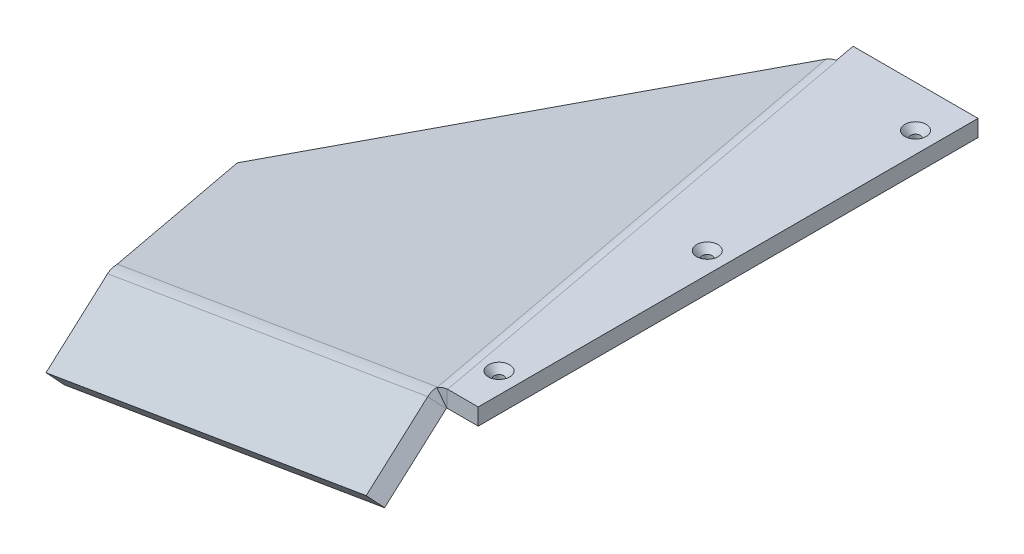
ISO-10303-21;
HEADER;
FILE_DESCRIPTION(('STEP AP214'),'2;1');
FILE_NAME('part.step','',(''),(''),'','','');
FILE_SCHEMA(('AUTOMOTIVE_DESIGN { 1 0 10303 214 1 1 1 1 }'));
ENDSEC;
DATA;
#1=APPLICATION_CONTEXT('core data for automotive mechanical design processes');
#2=APPLICATION_PROTOCOL_DEFINITION('international standard','automotive_design',2000,#1);
#3=PRODUCT_CONTEXT('',#1,'mechanical');
#4=PRODUCT('Part','Part','',(#3));
#5=PRODUCT_RELATED_PRODUCT_CATEGORY('part','',(#4));
#6=PRODUCT_DEFINITION_FORMATION('','',#4);
#7=PRODUCT_DEFINITION_CONTEXT('part definition',#1,'design');
#8=PRODUCT_DEFINITION('design','',#6,#7);
#9=PRODUCT_DEFINITION_SHAPE('','',#8);
#10=(LENGTH_UNIT() NAMED_UNIT(*) SI_UNIT(.MILLI.,.METRE.));
#11=(NAMED_UNIT(*) PLANE_ANGLE_UNIT() SI_UNIT($,.RADIAN.));
#12=(NAMED_UNIT(*) SI_UNIT($,.STERADIAN.) SOLID_ANGLE_UNIT());
#13=UNCERTAINTY_MEASURE_WITH_UNIT(LENGTH_MEASURE(1.E-05),#10,'distance_accuracy_value','');
#14=(GEOMETRIC_REPRESENTATION_CONTEXT(3) GLOBAL_UNCERTAINTY_ASSIGNED_CONTEXT((#13)) GLOBAL_UNIT_ASSIGNED_CONTEXT((#10,
#11,#12)) REPRESENTATION_CONTEXT('',''));
#15=CARTESIAN_POINT('',(0.,0.,0.));
#16=DIRECTION('',(0.,0.,1.));
#17=DIRECTION('',(1.,0.,0.));
#18=AXIS2_PLACEMENT_3D('',#15,#16,#17);
#19=CARTESIAN_POINT('',(-179.784736318723,-93.9799999999991,3.68196416054327));
#20=DIRECTION('',(0.829298407725834,0.433012701892212,0.353219692179532));
#21=DIRECTION('',(-0.462847675696148,0.886437831493373,0.));
#22=AXIS2_PLACEMENT_3D('',#19,#20,#21);
#23=PLANE('',#22);
#24=DIRECTION('',(0.491436093467156,-0.866025403784441,-0.0921442675250917));
#25=VECTOR('',#24,1.);
#26=CARTESIAN_POINT('',(-182.281231673536,-89.5805909487741,4.15005703957071));
#27=LINE('',#26,#25);
#28=CARTESIAN_POINT('',(-182.281231673536,-89.5805909487741,4.15005703957071));
#29=VERTEX_POINT('',#28);
#30=CARTESIAN_POINT('',(-182.279585554428,-89.5834917958712,4.14974839223797));
#31=VERTEX_POINT('',#30);
#32=EDGE_CURVE('E471',#29,#31,#27,.T.);
#33=ORIENTED_EDGE('',*,*,#32,.T.);
#34=CARTESIAN_POINT('',(-179.370244182487,-94.5685714686407,3.43033960882663));
#35=DIRECTION('',(-0.829298407725834,-0.433012701892215,-0.353219692179528));
#36=DIRECTION('',(0.46284767569615,-0.886437831493372,0.));
#37=AXIS2_PLACEMENT_3D('',#34,#35,#36);
#38=CIRCLE('',#37,5.8165999999998);
#39=CARTESIAN_POINT('',(-182.228731363748,-89.5312481049879,3.96630595531323));
#40=VERTEX_POINT('',#39);
#41=EDGE_CURVE('E11',#31,#40,#38,.T.);
#42=ORIENTED_EDGE('',*,*,#41,.T.);
#43=DIRECTION('',(0.265997588299476,0.250000000000002,-0.930991559048126));
#44=VECTOR('',#43,1.);
#45=CARTESIAN_POINT('',(-162.399193038281,-70.8942949917687,-65.4370781838173));
#46=LINE('',#45,#44);
#47=EDGE_CURVE('E441',#29,#40,#46,.T.);
#48=ORIENTED_EDGE('',*,*,#47,.F.);
#49=EDGE_LOOP('',(#33,#42,#48));
#50=FACE_BOUND('',#49,.T.);
#51=ADVANCED_FACE('F38',(#50),#23,.T.);
#52=CARTESIAN_POINT('',(-6.08541035334141,10.7239171654345,1.14101444125151));
#53=DIRECTION('',(-0.491436093467156,0.866025403784442,0.0921442675250916));
#54=DIRECTION('',(-0.869725505435452,-0.493535758780503,0.));
#55=AXIS2_PLACEMENT_3D('',#52,#53,#54);
#56=PLANE('',#55);
#57=DIRECTION('',(-0.184288535050185,0.,-0.982872186934322));
#58=VECTOR('',#57,1.);
#59=CARTESIAN_POINT('',(-190.768250996109,-89.5805909487741,-41.1140460141519));
#60=LINE('',#59,#58);
#61=CARTESIAN_POINT('',(-190.768250996109,-89.5805909487741,-41.1140460141519));
#62=VERTEX_POINT('',#61);
#63=EDGE_CURVE('E461',#29,#62,#60,.T.);
#64=ORIENTED_EDGE('',*,*,#63,.F.);
#65=ORIENTED_EDGE('',*,*,#47,.T.);
#66=DIRECTION('',(-0.829298407725834,-0.433012701892215,-0.353219692179528));
#67=VECTOR('',#66,1.);
#68=CARTESIAN_POINT('',(-182.228731363748,-89.5312481049885,3.96630595531413));
#69=LINE('',#68,#67);
#70=CARTESIAN_POINT('',(-12.2524967178797,-0.779276636347389,76.3635910822581));
#71=VERTEX_POINT('',#70);
#72=EDGE_CURVE('E203',#40,#71,#69,.F.);
#73=ORIENTED_EDGE('',*,*,#72,.T.);
#74=DIRECTION('',(-0.184288535050185,0.,-0.982872186934322));
#75=VECTOR('',#74,1.);
#76=CARTESIAN_POINT('',(-25.66826993104,-0.779276636347404,4.81280061206999));
#77=LINE('',#76,#75);
#78=CARTESIAN_POINT('',(-39.5942641485656,-0.779276636347423,-69.4591685480669));
#79=VERTEX_POINT('',#78);
#80=EDGE_CURVE('E451',#71,#79,#77,.T.);
#81=ORIENTED_EDGE('',*,*,#80,.T.);
#82=DIRECTION('',(0.851192282558293,0.499999999999995,-0.159598552979683));
#83=VECTOR('',#82,1.);
#84=CARTESIAN_POINT('',(-39.4262631572444,-0.680590948775023,-69.4906687339396));
#85=LINE('',#84,#83);
#86=EDGE_CURVE('E458',#62,#79,#85,.T.);
#87=ORIENTED_EDGE('',*,*,#86,.F.);
#88=EDGE_LOOP('',(#64,#65,#73,#81,#87));
#89=FACE_BOUND('',#88,.T.);
#90=ADVANCED_FACE('F251',(#89),#56,.T.);
#91=CARTESIAN_POINT('',(-3.58891499852826,6.32450811420956,0.672921562224048));
#92=DIRECTION('',(-0.491436093467156,0.866025403784442,0.0921442675250916));
#93=DIRECTION('',(-0.869725505435452,-0.493535758780503,0.));
#94=AXIS2_PLACEMENT_3D('',#91,#92,#93);
#95=PLANE('',#94);
#96=DIRECTION('',(0.265997588300528,0.249999999998149,-0.930991559048324));
#97=VECTOR('',#96,1.);
#98=CARTESIAN_POINT('',(-179.784736318723,-93.9799999999991,3.68196416054327));
#99=LINE('',#98,#97);
#100=CARTESIAN_POINT('',(-179.784736318723,-93.9799999999991,3.68196416054327));
#101=VERTEX_POINT('',#100);
#102=CARTESIAN_POINT('',(-179.732236008935,-93.9306571562133,3.49821307628573));
#103=VERTEX_POINT('',#102);
#104=EDGE_CURVE('E215',#101,#103,#99,.T.);
#105=ORIENTED_EDGE('',*,*,#104,.F.);
#106=DIRECTION('',(-0.184288535050185,0.,-0.982872186934322));
#107=VECTOR('',#106,1.);
#108=CARTESIAN_POINT('',(-188.271755641296,-93.9799999999991,-41.5821388931794));
#109=LINE('',#108,#107);
#110=CARTESIAN_POINT('',(-188.271755641296,-93.9799999999991,-41.5821388931794));
#111=VERTEX_POINT('',#110);
#112=EDGE_CURVE('E462',#101,#111,#109,.T.);
#113=ORIENTED_EDGE('',*,*,#112,.T.);
#114=DIRECTION('',(0.851192282558293,0.499999999999995,-0.159598552979683));
#115=VECTOR('',#114,1.);
#116=CARTESIAN_POINT('',(-36.9297678024313,-5.07999999999999,-69.9587616129671));
#117=LINE('',#116,#115);
#118=CARTESIAN_POINT('',(-37.0977687937524,-5.17868568757246,-69.9272614270944));
#119=VERTEX_POINT('',#118);
#120=EDGE_CURVE('E457',#111,#119,#117,.T.);
#121=ORIENTED_EDGE('',*,*,#120,.T.);
#122=DIRECTION('',(-0.184288535050185,0.,-0.982872186934322));
#123=VECTOR('',#122,1.);
#124=CARTESIAN_POINT('',(-9.71400111523626,-5.17868568757238,76.119499524992));
#125=LINE('',#124,#123);
#126=CARTESIAN_POINT('',(-9.75600136306651,-5.17868568757238,75.8954982032307));
#127=VERTEX_POINT('',#126);
#128=EDGE_CURVE('E449',#127,#119,#125,.T.);
#129=ORIENTED_EDGE('',*,*,#128,.F.);
#130=DIRECTION('',(-0.829298407725834,-0.433012701892215,-0.353219692179528));
#131=VECTOR('',#130,1.);
#132=CARTESIAN_POINT('',(-179.732236008935,-93.9306571562133,3.49821307628571));
#133=LINE('',#132,#131);
#134=EDGE_CURVE('E207',#103,#127,#133,.F.);
#135=ORIENTED_EDGE('',*,*,#134,.F.);
#136=EDGE_LOOP('',(#105,#113,#121,#129,#135));
#137=FACE_BOUND('',#136,.T.);
#138=ADVANCED_FACE('F256',(#137),#95,.F.);
#139=CARTESIAN_POINT('',(-36.9297678024313,-5.07999999999999,-69.9587616129671));
#140=DIRECTION('',(0.184288535050179,0.,0.982872186934323));
#141=DIRECTION('',(0.982872186934323,0.,-0.184288535050179));
#142=AXIS2_PLACEMENT_3D('',#139,#140,#141);
#143=PLANE('',#142);
#144=DIRECTION('',(0.,1.,0.));
#145=VECTOR('',#144,1.);
#146=CARTESIAN_POINT('',(-36.9297678024313,-5.07999999999999,-69.9587616129671));
#147=LINE('',#146,#145);
#148=CARTESIAN_POINT('',(-36.9297678024313,-0.00334960970435876,-69.9587616129671));
#149=VERTEX_POINT('',#148);
#150=CARTESIAN_POINT('',(-36.9297678024313,0.,-69.9587616129671));
#151=VERTEX_POINT('',#150);
#152=EDGE_CURVE('E364',#149,#151,#147,.T.);
#153=ORIENTED_EDGE('',*,*,#152,.F.);
#154=CARTESIAN_POINT('',(-36.7357769673045,-5.81660000000001,-69.9951348945533));
#155=DIRECTION('',(-0.184288535050185,0.,-0.982872186934322));
#156=DIRECTION('',(-0.982872186934322,0.,0.184288535050185));
#157=AXIS2_PLACEMENT_3D('',#154,#155,#156);
#158=CIRCLE('',#157,5.81659999999992);
#159=CARTESIAN_POINT('',(-36.7357769673046,0.,-69.9951348945533));
#160=VERTEX_POINT('',#159);
#161=EDGE_CURVE('E47',#149,#160,#158,.T.);
#162=ORIENTED_EDGE('',*,*,#161,.T.);
#163=DIRECTION('',(-0.982872186934323,0.,0.184288535050179));
#164=VECTOR('',#163,1.);
#165=CARTESIAN_POINT('',(-13.9259942175252,0.,-74.2719691601368));
#166=LINE('',#165,#164);
#167=EDGE_CURVE('E398',#160,#151,#166,.T.);
#168=ORIENTED_EDGE('',*,*,#167,.T.);
#169=EDGE_LOOP('',(#153,#162,#168));
#170=FACE_BOUND('',#169,.T.);
#171=ADVANCED_FACE('F264',(#170),#143,.T.);
#172=CARTESIAN_POINT('',(-9.52499999999998,-5.08,76.2));
#173=DIRECTION('',(-0.982872186934322,0.,0.184288535050185));
#174=DIRECTION('',(0.184288535050185,0.,0.982872186934322));
#175=AXIS2_PLACEMENT_3D('',#172,#173,#174);
#176=PLANE('',#175);
#177=DIRECTION('',(0.184288535050185,0.,0.982872186934322));
#178=VECTOR('',#177,1.);
#179=CARTESIAN_POINT('',(-9.52499999999998,-5.08,76.2));
#180=LINE('',#179,#178);
#181=CARTESIAN_POINT('',(-38.1,-5.08,-76.2));
#182=VERTEX_POINT('',#181);
#183=CARTESIAN_POINT('',(-36.9297678024313,-5.08,-69.9587616129671));
#184=VERTEX_POINT('',#183);
#185=EDGE_CURVE('E344',#182,#184,#180,.T.);
#186=ORIENTED_EDGE('',*,*,#185,.T.);
#187=EDGE_CURVE('E346',#184,#149,#147,.T.);
#188=ORIENTED_EDGE('',*,*,#187,.T.);
#189=ORIENTED_EDGE('',*,*,#152,.T.);
#190=DIRECTION('',(0.184288535050185,0.,0.982872186934322));
#191=VECTOR('',#190,1.);
#192=CARTESIAN_POINT('',(-9.52499999999998,0.,76.2));
#193=LINE('',#192,#191);
#194=CARTESIAN_POINT('',(-38.1,0.,-76.2));
#195=VERTEX_POINT('',#194);
#196=EDGE_CURVE('E379',#195,#151,#193,.T.);
#197=ORIENTED_EDGE('',*,*,#196,.F.);
#198=DIRECTION('',(0.,1.,0.));
#199=VECTOR('',#198,1.);
#200=CARTESIAN_POINT('',(-38.1,-5.08,-76.2));
#201=LINE('',#200,#199);
#202=EDGE_CURVE('E349',#182,#195,#201,.T.);
#203=ORIENTED_EDGE('',*,*,#202,.F.);
#204=EDGE_LOOP('',(#186,#188,#189,#197,#203));
#205=FACE_BOUND('',#204,.T.);
#206=ADVANCED_FACE('F321',(#205),#176,.T.);
#207=CARTESIAN_POINT('',(0.,-5.08,0.));
#208=DIRECTION('',(0.,-1.,0.));
#209=DIRECTION('',(0.,0.,-1.));
#210=AXIS2_PLACEMENT_3D('',#207,#208,#209);
#211=PLANE('',#210);
#212=CARTESIAN_POINT('',(-6.34999999999998,-5.08,-63.5));
#213=DIRECTION('',(0.,-1.,0.));
#214=DIRECTION('',(0.,0.,-1.));
#215=AXIS2_PLACEMENT_3D('',#212,#213,#214);
#216=CIRCLE('',#215,1.47319999999999);
#217=CARTESIAN_POINT('',(-6.34999999999998,-5.08,-64.9732));
#218=VERTEX_POINT('',#217);
#219=EDGE_CURVE('E42',#218,#218,#216,.T.);
#220=ORIENTED_EDGE('',*,*,#219,.F.);
#221=EDGE_LOOP('',(#220));
#222=FACE_BOUND('',#221,.T.);
#223=CARTESIAN_POINT('',(-6.34999999999997,-5.08,0.));
#224=DIRECTION('',(0.,-1.,0.));
#225=DIRECTION('',(0.,0.,-1.));
#226=AXIS2_PLACEMENT_3D('',#223,#224,#225);
#227=CIRCLE('',#226,1.47319999999999);
#228=CARTESIAN_POINT('',(-6.34999999999997,-5.08,-1.47319999999999));
#229=VERTEX_POINT('',#228);
#230=EDGE_CURVE('E404',#229,#229,#227,.T.);
#231=ORIENTED_EDGE('',*,*,#230,.F.);
#232=EDGE_LOOP('',(#231));
#233=FACE_BOUND('',#232,.T.);
#234=CARTESIAN_POINT('',(-6.34999999999996,-5.08,63.5));
#235=DIRECTION('',(0.,-1.,0.));
#236=DIRECTION('',(0.,0.,-1.));
#237=AXIS2_PLACEMENT_3D('',#234,#235,#236);
#238=CIRCLE('',#237,1.47319999999999);
#239=CARTESIAN_POINT('',(-6.34999999999996,-5.08,62.0268));
#240=VERTEX_POINT('',#239);
#241=EDGE_CURVE('E401',#240,#240,#238,.T.);
#242=ORIENTED_EDGE('',*,*,#241,.F.);
#243=EDGE_LOOP('',(#242));
#244=FACE_BOUND('',#243,.T.);
#245=DIRECTION('',(-0.184288535050185,0.,-0.982872186934322));
#246=VECTOR('',#245,1.);
#247=CARTESIAN_POINT('',(-36.7357769673046,-5.08000000000009,-69.9951348945534));
#248=LINE('',#247,#246);
#249=CARTESIAN_POINT('',(-36.7357769673046,-5.08000000000009,-69.9951348945533));
#250=VERTEX_POINT('',#249);
#251=CARTESIAN_POINT('',(-9.33100916487329,-5.08,76.1636267184138));
#252=VERTEX_POINT('',#251);
#253=EDGE_CURVE('E475',#250,#252,#248,.F.);
#254=ORIENTED_EDGE('',*,*,#253,.F.);
#255=DIRECTION('',(0.982872186934323,-5.27348043667875E-13,-0.184288535050179));
#256=VECTOR('',#255,1.);
#257=CARTESIAN_POINT('',(-36.9297678024313,-5.07999999999999,-69.9587616129671));
#258=LINE('',#257,#256);
#259=EDGE_CURVE('E359',#184,#250,#258,.T.);
#260=ORIENTED_EDGE('',*,*,#259,.F.);
#261=ORIENTED_EDGE('',*,*,#185,.F.);
#262=DIRECTION('',(-1.,0.,0.));
#263=VECTOR('',#262,1.);
#264=CARTESIAN_POINT('',(-38.1,-5.08,-76.2));
#265=LINE('',#264,#263);
#266=CARTESIAN_POINT('',(0.,-5.08,-76.2));
#267=VERTEX_POINT('',#266);
#268=EDGE_CURVE('E354',#267,#182,#265,.T.);
#269=ORIENTED_EDGE('',*,*,#268,.F.);
#270=DIRECTION('',(0.,0.,-1.));
#271=VECTOR('',#270,1.);
#272=CARTESIAN_POINT('',(0.,-5.08,-76.2));
#273=LINE('',#272,#271);
#274=CARTESIAN_POINT('',(0.,-5.08,76.2));
#275=VERTEX_POINT('',#274);
#276=EDGE_CURVE('E374',#275,#267,#273,.T.);
#277=ORIENTED_EDGE('',*,*,#276,.F.);
#278=DIRECTION('',(1.,0.,0.));
#279=VECTOR('',#278,1.);
#280=CARTESIAN_POINT('',(0.,-5.08,76.2));
#281=LINE('',#280,#279);
#282=CARTESIAN_POINT('',(-9.52499999999998,-5.08,76.2));
#283=VERTEX_POINT('',#282);
#284=EDGE_CURVE('E353',#283,#275,#281,.T.);
#285=ORIENTED_EDGE('',*,*,#284,.F.);
#286=DIRECTION('',(-0.982872186934341,0.,0.184288535050081));
#287=VECTOR('',#286,1.);
#288=CARTESIAN_POINT('',(-9.33100916487329,-5.08000000000001,76.1636267184138));
#289=LINE('',#288,#287);
#290=EDGE_CURVE('E367',#252,#283,#289,.T.);
#291=ORIENTED_EDGE('',*,*,#290,.F.);
#292=EDGE_LOOP('',(#254,#260,#261,#269,#277,#285,#291));
#293=FACE_BOUND('',#292,.T.);
#294=ADVANCED_FACE('F323',(#222,#233,#244,#293),#211,.T.);
#295=CARTESIAN_POINT('',(0.,0.,0.));
#296=DIRECTION('',(0.,-1.,0.));
#297=DIRECTION('',(0.,0.,-1.));
#298=AXIS2_PLACEMENT_3D('',#295,#296,#297);
#299=PLANE('',#298);
#300=CARTESIAN_POINT('',(-6.34999999999998,0.,-63.5));
#301=DIRECTION('',(0.,1.,0.));
#302=DIRECTION('',(0.,0.,1.));
#303=AXIS2_PLACEMENT_3D('',#300,#301,#302);
#304=CIRCLE('',#303,3.2385);
#305=CARTESIAN_POINT('',(-6.34999999999998,0.,-60.2615));
#306=VERTEX_POINT('',#305);
#307=EDGE_CURVE('E694',#306,#306,#304,.T.);
#308=ORIENTED_EDGE('',*,*,#307,.F.);
#309=EDGE_LOOP('',(#308));
#310=FACE_BOUND('',#309,.T.);
#311=CARTESIAN_POINT('',(-6.34999999999997,0.,0.));
#312=DIRECTION('',(0.,1.,0.));
#313=DIRECTION('',(0.,0.,1.));
#314=AXIS2_PLACEMENT_3D('',#311,#312,#313);
#315=CIRCLE('',#314,3.2385);
#316=CARTESIAN_POINT('',(-6.34999999999997,0.,3.2385));
#317=VERTEX_POINT('',#316);
#318=EDGE_CURVE('E413',#317,#317,#315,.T.);
#319=ORIENTED_EDGE('',*,*,#318,.F.);
#320=EDGE_LOOP('',(#319));
#321=FACE_BOUND('',#320,.T.);
#322=CARTESIAN_POINT('',(-6.34999999999996,0.,63.5));
#323=DIRECTION('',(0.,1.,0.));
#324=DIRECTION('',(0.,0.,1.));
#325=AXIS2_PLACEMENT_3D('',#322,#323,#324);
#326=CIRCLE('',#325,3.2385);
#327=CARTESIAN_POINT('',(-6.34999999999996,0.,66.7385));
#328=VERTEX_POINT('',#327);
#329=EDGE_CURVE('E406',#328,#328,#326,.T.);
#330=ORIENTED_EDGE('',*,*,#329,.F.);
#331=EDGE_LOOP('',(#330));
#332=FACE_BOUND('',#331,.T.);
#333=ORIENTED_EDGE('',*,*,#167,.F.);
#334=DIRECTION('',(-0.184288535050185,0.,-0.982872186934322));
#335=VECTOR('',#334,1.);
#336=CARTESIAN_POINT('',(-36.7357769673047,0.,-69.9951348945533));
#337=LINE('',#336,#335);
#338=CARTESIAN_POINT('',(-9.33100916487329,0.,76.1636267184138));
#339=VERTEX_POINT('',#338);
#340=EDGE_CURVE('E291',#160,#339,#337,.F.);
#341=ORIENTED_EDGE('',*,*,#340,.T.);
#342=DIRECTION('',(0.982872186934342,0.,-0.184288535050081));
#343=VECTOR('',#342,1.);
#344=CARTESIAN_POINT('',(13.4787735848985,0.,71.8867924528341));
#345=LINE('',#344,#343);
#346=CARTESIAN_POINT('',(-9.52499999999998,0.,76.2));
#347=VERTEX_POINT('',#346);
#348=EDGE_CURVE('E389',#347,#339,#345,.T.);
#349=ORIENTED_EDGE('',*,*,#348,.F.);
#350=DIRECTION('',(1.,0.,0.));
#351=VECTOR('',#350,1.);
#352=CARTESIAN_POINT('',(0.,0.,76.2));
#353=LINE('',#352,#351);
#354=CARTESIAN_POINT('',(0.,0.,76.2));
#355=VERTEX_POINT('',#354);
#356=EDGE_CURVE('E382',#347,#355,#353,.T.);
#357=ORIENTED_EDGE('',*,*,#356,.T.);
#358=DIRECTION('',(0.,0.,-1.));
#359=VECTOR('',#358,1.);
#360=CARTESIAN_POINT('',(0.,0.,-76.2));
#361=LINE('',#360,#359);
#362=CARTESIAN_POINT('',(0.,0.,-76.2));
#363=VERTEX_POINT('',#362);
#364=EDGE_CURVE('E370',#355,#363,#361,.T.);
#365=ORIENTED_EDGE('',*,*,#364,.T.);
#366=DIRECTION('',(-1.,0.,0.));
#367=VECTOR('',#366,1.);
#368=CARTESIAN_POINT('',(-38.1,0.,-76.2));
#369=LINE('',#368,#367);
#370=EDGE_CURVE('E366',#363,#195,#369,.T.);
#371=ORIENTED_EDGE('',*,*,#370,.T.);
#372=ORIENTED_EDGE('',*,*,#196,.T.);
#373=EDGE_LOOP('',(#333,#341,#349,#357,#365,#371,#372));
#374=FACE_BOUND('',#373,.T.);
#375=ADVANCED_FACE('F326',(#310,#321,#332,#374),#299,.F.);
#376=CARTESIAN_POINT('',(-38.1,-5.08,-76.2));
#377=DIRECTION('',(0.,0.,-1.));
#378=DIRECTION('',(-1.,0.,0.));
#379=AXIS2_PLACEMENT_3D('',#376,#377,#378);
#380=PLANE('',#379);
#381=ORIENTED_EDGE('',*,*,#370,.F.);
#382=DIRECTION('',(0.,1.,0.));
#383=VECTOR('',#382,1.);
#384=CARTESIAN_POINT('',(0.,-5.08,-76.2));
#385=LINE('',#384,#383);
#386=EDGE_CURVE('E387',#267,#363,#385,.T.);
#387=ORIENTED_EDGE('',*,*,#386,.F.);
#388=ORIENTED_EDGE('',*,*,#268,.T.);
#389=ORIENTED_EDGE('',*,*,#202,.T.);
#390=EDGE_LOOP('',(#381,#387,#388,#389));
#391=FACE_BOUND('',#390,.T.);
#392=ADVANCED_FACE('F40',(#391),#380,.T.);
#393=CARTESIAN_POINT('',(0.,-5.08,-76.2));
#394=DIRECTION('',(1.,0.,0.));
#395=DIRECTION('',(0.,0.,-1.));
#396=AXIS2_PLACEMENT_3D('',#393,#394,#395);
#397=PLANE('',#396);
#398=ORIENTED_EDGE('',*,*,#364,.F.);
#399=DIRECTION('',(0.,1.,0.));
#400=VECTOR('',#399,1.);
#401=CARTESIAN_POINT('',(0.,-5.08,76.2));
#402=LINE('',#401,#400);
#403=EDGE_CURVE('E390',#275,#355,#402,.T.);
#404=ORIENTED_EDGE('',*,*,#403,.F.);
#405=ORIENTED_EDGE('',*,*,#276,.T.);
#406=ORIENTED_EDGE('',*,*,#386,.T.);
#407=EDGE_LOOP('',(#398,#404,#405,#406));
#408=FACE_BOUND('',#407,.T.);
#409=ADVANCED_FACE('F331',(#408),#397,.T.);
#410=CARTESIAN_POINT('',(0.,-5.08,76.2));
#411=DIRECTION('',(0.,0.,1.));
#412=DIRECTION('',(1.,0.,0.));
#413=AXIS2_PLACEMENT_3D('',#410,#411,#412);
#414=PLANE('',#413);
#415=ORIENTED_EDGE('',*,*,#356,.F.);
#416=DIRECTION('',(0.,1.,0.));
#417=VECTOR('',#416,1.);
#418=CARTESIAN_POINT('',(-9.52499999999998,-5.08,76.2));
#419=LINE('',#418,#417);
#420=EDGE_CURVE('E392',#283,#347,#419,.T.);
#421=ORIENTED_EDGE('',*,*,#420,.F.);
#422=ORIENTED_EDGE('',*,*,#284,.T.);
#423=ORIENTED_EDGE('',*,*,#403,.T.);
#424=EDGE_LOOP('',(#415,#421,#422,#423));
#425=FACE_BOUND('',#424,.T.);
#426=ADVANCED_FACE('F317',(#425),#414,.T.);
#427=CARTESIAN_POINT('',(-9.33100916487329,-5.08000000000001,76.1636267184138));
#428=DIRECTION('',(-0.184288535050081,0.,-0.982872186934341));
#429=DIRECTION('',(-0.982872186934342,0.,0.184288535050081));
#430=AXIS2_PLACEMENT_3D('',#427,#428,#429);
#431=PLANE('',#430);
#432=ORIENTED_EDGE('',*,*,#420,.T.);
#433=ORIENTED_EDGE('',*,*,#348,.T.);
#434=DIRECTION('',(0.,1.,0.));
#435=VECTOR('',#434,1.);
#436=CARTESIAN_POINT('',(-9.33100916487331,-5.08000000000001,76.1636267184137));
#437=LINE('',#436,#435);
#438=EDGE_CURVE('E290',#252,#339,#437,.T.);
#439=ORIENTED_EDGE('',*,*,#438,.F.);
#440=ORIENTED_EDGE('',*,*,#290,.T.);
#441=EDGE_LOOP('',(#432,#433,#439,#440));
#442=FACE_BOUND('',#441,.T.);
#443=ADVANCED_FACE('F313',(#442),#431,.T.);
#444=CARTESIAN_POINT('',(-36.7357769673045,-5.81660000000001,-69.9951348945533));
#445=DIRECTION('',(0.184288535050185,0.,0.982872186934322));
#446=DIRECTION('',(0.982872186934322,0.,-0.184288535050185));
#447=AXIS2_PLACEMENT_3D('',#444,#445,#446);
#448=PLANE('',#447);
#449=ORIENTED_EDGE('',*,*,#187,.F.);
#450=ORIENTED_EDGE('',*,*,#259,.T.);
#451=CARTESIAN_POINT('',(-36.7357769673045,-5.81660000000001,-69.9951348945533));
#452=DIRECTION('',(-0.184288535050185,0.,-0.982872186934322));
#453=DIRECTION('',(-0.982872186934322,0.,0.184288535050185));
#454=AXIS2_PLACEMENT_3D('',#451,#452,#453);
#455=CIRCLE('',#454,0.736599999999922);
#456=EDGE_CURVE('E470',#119,#250,#455,.T.);
#457=ORIENTED_EDGE('',*,*,#456,.F.);
#458=DIRECTION('',(-0.491436093467156,0.866025403784442,0.0921442675250916));
#459=VECTOR('',#458,1.);
#460=CARTESIAN_POINT('',(-37.0977687937525,-5.17868568757238,-69.9272614270944));
#461=LINE('',#460,#459);
#462=EDGE_CURVE('E448',#119,#79,#461,.T.);
#463=ORIENTED_EDGE('',*,*,#462,.T.);
#464=EDGE_CURVE('E363',#79,#149,#158,.T.);
#465=ORIENTED_EDGE('',*,*,#464,.T.);
#466=EDGE_LOOP('',(#449,#450,#457,#463,#465));
#467=FACE_BOUND('',#466,.T.);
#468=ADVANCED_FACE('F303',(#467),#448,.F.);
#469=CARTESIAN_POINT('',(-9.33100916487303,0.0507999999999948,76.1636267184138));
#470=CARTESIAN_POINT('',(-10.3461631085407,0.0508000000000357,76.3152594851445));
#471=CARTESIAN_POINT('',(-11.3553729743469,-0.222427167268184,76.4659653462821));
#472=CARTESIAN_POINT('',(-12.2354614235977,-0.735282545835216,76.5922733328097));
#473=CARTESIAN_POINT('',(-9.33100916487303,0.,76.1636267184138));
#474=CARTESIAN_POINT('',(-10.3374344782095,0.,76.3136229029513));
#475=CARTESIAN_POINT('',(-11.3379672372793,-0.270861623439154,76.4627017345881));
#476=CARTESIAN_POINT('',(-12.2104964700495,-0.779276636347465,76.5875924040194));
#477=CARTESIAN_POINT('',(-9.33100916487323,-5.08000000000001,76.1636267184138));
#478=CARTESIAN_POINT('',(-9.46457144508943,-5.08,76.1499646836328));
#479=CARTESIAN_POINT('',(-9.5973935305193,-5.11430724053615,76.136340565179));
#480=CARTESIAN_POINT('',(-9.7140011152363,-5.17868568757238,76.119499524992));
#481=B_SPLINE_SURFACE_WITH_KNOTS('',1,3,((#469,#470,#471,#472),(#473,#474,#475,#476),(#477,#478,
#479,#480)),.UNSPECIFIED.,.F.,.F.,.F.,(2,1,2),(4,4),(-0.01,0.,1.),(0.,1.),.UNSPECIFIED.);
#482=DIRECTION('',(-0.491436093467156,0.866025403784442,0.0921442675250916));
#483=VECTOR('',#482,1.);
#484=CARTESIAN_POINT('',(-9.71400111523626,-5.17868568757238,76.119499524992));
#485=LINE('',#484,#483);
#486=CARTESIAN_POINT('',(-9.71400111523628,-5.17868568757237,76.119499524992));
#487=VERTEX_POINT('',#486);
#488=CARTESIAN_POINT('',(-12.2104964700494,-0.779276636347407,76.5875924040195));
#489=VERTEX_POINT('',#488);
#490=EDGE_CURVE('E442',#487,#489,#485,.T.);
#491=CARTESIAN_POINT('',(-9.33100916487323,-5.08000000000001,76.1636267184138));
#492=CARTESIAN_POINT('',(-9.36331608331792,-5.0799900028254,76.1603206886018));
#493=CARTESIAN_POINT('',(-9.39561963686488,-5.08197526117828,76.1570156384141));
#494=CARTESIAN_POINT('',(-9.45967585347407,-5.08985143503081,76.1503211400138));
#495=CARTESIAN_POINT('',(-9.49142944097762,-5.09573497406579,76.1469318628145));
#496=CARTESIAN_POINT('',(-9.55577934669813,-5.11177513802922,76.1397690564108));
#497=CARTESIAN_POINT('',(-9.58831784874134,-5.12215965224229,76.1359846417348));
#498=CARTESIAN_POINT('',(-9.65230055778382,-5.14721206186289,76.1280413236226));
#499=CARTESIAN_POINT('',(-9.68371683513585,-5.16194963602705,76.1238771561832));
#500=CARTESIAN_POINT('',(-9.71400111523629,-5.17868568757238,76.119499524992));
#501=B_SPLINE_CURVE_WITH_KNOTS('',3,(#491,#492,#493,#494,#495,#496,#497,#498,#499,#500),
.UNSPECIFIED.,.F.,.F.,(4,2,2,2,4),(0.,0.0973606937519752,0.194537682290696,0.297346674602982,
0.401899820800888),.UNSPECIFIED.);
#502=EDGE_CURVE('E293',#252,#487,#501,.T.);
#503=CARTESIAN_POINT('',(-9.33100916487339,0.,76.1636267184138));
#504=CARTESIAN_POINT('',(-9.46089624287596,7.32643245585607E-06,76.1829847467309));
#505=CARTESIAN_POINT('',(-9.59078269066899,-0.00444076660831353,76.2023423467972));
#506=CARTESIAN_POINT('',(-9.84992656530212,-0.022192657502334,76.2409411404455));
#507=CARTESIAN_POINT('',(-9.9791841688394,-0.0354938033761932,76.2601823671464));
#508=CARTESIAN_POINT('',(-10.2365240697325,-0.0708971361706478,76.2984450322274));
#509=CARTESIAN_POINT('',(-10.3646063397215,-0.0929995274929266,76.3174664654923));
#510=CARTESIAN_POINT('',(-10.6190446770946,-0.145909215925621,76.355184770882));
#511=CARTESIAN_POINT('',(-10.7454002994494,-0.176718714455867,76.3738815596564));
#512=CARTESIAN_POINT('',(-10.9874003595327,-0.244551251524937,76.4096009203176));
#513=CARTESIAN_POINT('',(-11.103196071774,-0.281021071432599,76.4266518464583));
#514=CARTESIAN_POINT('',(-11.3323255100609,-0.361279099960415,76.4602904544564));
#515=CARTESIAN_POINT('',(-11.4456586282089,-0.405069092904747,76.4768780222148));
#516=CARTESIAN_POINT('',(-11.6696064661817,-0.49988264455546,76.5095335663654));
#517=CARTESIAN_POINT('',(-11.7802152949245,-0.550920497353851,76.5256004370487));
#518=CARTESIAN_POINT('',(-11.9980186529501,-0.659941462555055,76.5570950272821));
#519=CARTESIAN_POINT('',(-12.1052139208949,-0.717923059291052,76.5725228853288));
#520=CARTESIAN_POINT('',(-12.2104964700494,-0.779276636347411,76.5875924040194));
#521=B_SPLINE_CURVE_WITH_KNOTS('',3,(#503,#504,#505,#506,#507,#508,#509,#510,#511,#512,#513,
#514,#515,#516,#517,#518,#519,#520),.UNSPECIFIED.,.F.,.F.,(4,2,2,2,2,2,2,2,4),(0.,
0.393888875450166,0.7876598124498,1.18143989498884,1.57531962623802,1.94286246645075,
2.31049502782485,2.67886296476463,3.04715064112737),.UNSPECIFIED.);
#522=EDGE_CURVE('E283',#339,#489,#521,.T.);
#523=ORIENTED_EDGE('',*,*,#490,.F.);
#524=ORIENTED_EDGE('',*,*,#502,.F.);
#525=ORIENTED_EDGE('',*,*,#438,.T.);
#526=ORIENTED_EDGE('',*,*,#522,.T.);
#527=EDGE_LOOP('',(#523,#524,#525,#526));
#528=FACE_BOUND('',#527,.T.);
#529=ADVANCED_FACE('F278',(#528),#481,.F.);
#530=CARTESIAN_POINT('',(-36.7357769673045,-5.81660000000001,-69.9951348945534));
#531=DIRECTION('',(-0.184288535050185,0.,-0.982872186934322));
#532=DIRECTION('',(-0.491436093467156,0.866025403784442,0.0921442675250911));
#533=AXIS2_PLACEMENT_3D('',#530,#531,#532);
#534=CYLINDRICAL_SURFACE('',#533,5.81659999999992);
#535=ORIENTED_EDGE('',*,*,#340,.F.);
#536=ORIENTED_EDGE('',*,*,#161,.F.);
#537=ORIENTED_EDGE('',*,*,#464,.F.);
#538=ORIENTED_EDGE('',*,*,#80,.F.);
#539=EDGE_CURVE('E454',#489,#71,#77,.T.);
#540=ORIENTED_EDGE('',*,*,#539,.F.);
#541=ORIENTED_EDGE('',*,*,#522,.F.);
#542=EDGE_LOOP('',(#535,#536,#537,#538,#540,#541));
#543=FACE_BOUND('',#542,.T.);
#544=ADVANCED_FACE('F274',(#543),#534,.T.);
#545=CARTESIAN_POINT('',(-36.7357769673045,-5.81660000000001,-69.9951348945534));
#546=DIRECTION('',(-0.184288535050185,0.,-0.982872186934322));
#547=DIRECTION('',(-0.491436093467156,0.866025403784442,0.0921442675250911));
#548=AXIS2_PLACEMENT_3D('',#545,#546,#547);
#549=CYLINDRICAL_SURFACE('',#548,0.736599999999922);
#550=ORIENTED_EDGE('',*,*,#253,.T.);
#551=ORIENTED_EDGE('',*,*,#502,.T.);
#552=EDGE_CURVE('E445',#487,#127,#125,.T.);
#553=ORIENTED_EDGE('',*,*,#552,.T.);
#554=ORIENTED_EDGE('',*,*,#128,.T.);
#555=ORIENTED_EDGE('',*,*,#456,.T.);
#556=EDGE_LOOP('',(#550,#551,#553,#554,#555));
#557=FACE_BOUND('',#556,.T.);
#558=ADVANCED_FACE('F272',(#557),#549,.F.);
#559=CARTESIAN_POINT('',(-39.4262631572444,-0.680590948775023,-69.4906687339396));
#560=DIRECTION('',(-0.184288535050188,0.,-0.982872186934321));
#561=DIRECTION('',(-0.982872186934322,0.,0.184288535050188));
#562=AXIS2_PLACEMENT_3D('',#559,#560,#561);
#563=PLANE('',#562);
#564=ORIENTED_EDGE('',*,*,#86,.T.);
#565=ORIENTED_EDGE('',*,*,#462,.F.);
#566=ORIENTED_EDGE('',*,*,#120,.F.);
#567=DIRECTION('',(0.491436093467156,-0.866025403784441,-0.0921442675250917));
#568=VECTOR('',#567,1.);
#569=CARTESIAN_POINT('',(-190.768250996109,-89.5805909487741,-41.1140460141519));
#570=LINE('',#569,#568);
#571=EDGE_CURVE('E468',#62,#111,#570,.T.);
#572=ORIENTED_EDGE('',*,*,#571,.F.);
#573=EDGE_LOOP('',(#564,#565,#566,#572));
#574=FACE_BOUND('',#573,.T.);
#575=ADVANCED_FACE('F269',(#574),#563,.T.);
#576=CARTESIAN_POINT('',(-190.768250996109,-89.5805909487741,-41.1140460141519));
#577=DIRECTION('',(-0.851192282558293,-0.499999999999995,0.15959855297968));
#578=DIRECTION('',(0.506492217042362,-0.862244532644605,0.));
#579=AXIS2_PLACEMENT_3D('',#576,#577,#578);
#580=PLANE('',#579);
#581=ORIENTED_EDGE('',*,*,#112,.F.);
#582=EDGE_CURVE('E56',#31,#101,#27,.T.);
#583=ORIENTED_EDGE('',*,*,#582,.F.);
#584=ORIENTED_EDGE('',*,*,#32,.F.);
#585=ORIENTED_EDGE('',*,*,#63,.T.);
#586=ORIENTED_EDGE('',*,*,#571,.T.);
#587=EDGE_LOOP('',(#581,#583,#584,#585,#586));
#588=FACE_BOUND('',#587,.T.);
#589=ADVANCED_FACE('F266',(#588),#580,.T.);
#590=CARTESIAN_POINT('',(-9.75600136306672,-5.17868568757255,75.8954982032307));
#591=DIRECTION('',(-0.851192282558097,-0.499999999999995,0.159598552980727));
#592=DIRECTION('',(0.506492217042448,-0.862244532644554,0.));
#593=AXIS2_PLACEMENT_3D('',#590,#591,#592);
#594=PLANE('',#593);
#595=ORIENTED_EDGE('',*,*,#539,.T.);
#596=DIRECTION('',(-0.491436093467215,0.866025403784387,0.0921442675252904));
#597=VECTOR('',#596,1.);
#598=CARTESIAN_POINT('',(-9.75600136306702,-5.17868568757269,75.8954982032306));
#599=LINE('',#598,#597);
#600=EDGE_CURVE('E212',#127,#71,#599,.T.);
#601=ORIENTED_EDGE('',*,*,#600,.F.);
#602=ORIENTED_EDGE('',*,*,#552,.F.);
#603=ORIENTED_EDGE('',*,*,#490,.T.);
#604=EDGE_LOOP('',(#595,#601,#602,#603));
#605=FACE_BOUND('',#604,.T.);
#606=ADVANCED_FACE('F260',(#605),#594,.T.);
#607=CARTESIAN_POINT('',(-12.2774616714275,-0.735282545834904,76.3682720110473));
#608=CARTESIAN_POINT('',(-12.5187471002324,-0.97523600529985,77.3366385245264));
#609=CARTESIAN_POINT('',(-12.6243122897562,-1.45038770657208,78.2741654554967));
#610=CARTESIAN_POINT('',(-12.5770089031359,-2.10013215621351,79.0673391849312));
#611=CARTESIAN_POINT('',(-12.2524967178794,-0.779276636347156,76.3635910822571));
#612=CARTESIAN_POINT('',(-12.4914199229099,-1.01700992830161,77.3236896973454));
#613=CARTESIAN_POINT('',(-12.595799252951,-1.48790589544703,78.2532155241265));
#614=CARTESIAN_POINT('',(-12.5486322804161,-2.13188215621351,79.0396381960857));
#615=CARTESIAN_POINT('',(-9.75600136306645,-5.17868568757235,75.8954982032305));
#616=CARTESIAN_POINT('',(-9.75870219066312,-5.19440222847807,76.0288069792475));
#617=CARTESIAN_POINT('',(-9.7444955724231,-5.23972478294178,76.1582223871008));
#618=CARTESIAN_POINT('',(-9.71097000843736,-5.30688215621376,76.2695393115354));
#619=B_SPLINE_SURFACE_WITH_KNOTS('',1,3,((#607,#608,#609,#610),(#611,#612,#613,#614),(#615,#616,
#617,#618)),.UNSPECIFIED.,.F.,.F.,.F.,(2,1,2),(4,4),(-0.01,0.,1.),(0.,1.),.UNSPECIFIED.);
#620=DIRECTION('',(-0.558594935428877,0.625000000000007,0.545295056013898));
#621=VECTOR('',#620,1.);
#622=CARTESIAN_POINT('',(-9.71097000843743,-5.3068821562138,76.2695393115354));
#623=LINE('',#622,#621);
#624=CARTESIAN_POINT('',(-9.71097000843723,-5.30688215621371,76.2695393115355));
#625=VERTEX_POINT('',#624);
#626=CARTESIAN_POINT('',(-12.5486322804159,-2.13188215621361,79.039638196086));
#627=VERTEX_POINT('',#626);
#628=EDGE_CURVE('E172',#625,#627,#623,.T.);
#629=CARTESIAN_POINT('',(-9.75600136306645,-5.17868568757235,75.8954982032305));
#630=CARTESIAN_POINT('',(-9.75665838827983,-5.18247800456525,75.9277449637213));
#631=CARTESIAN_POINT('',(-9.75633535395259,-5.18799816728997,75.9598044027611));
#632=CARTESIAN_POINT('',(-9.75363714182782,-5.2022896801044,76.0230382672838));
#633=CARTESIAN_POINT('',(-9.75126583727124,-5.21105487603201,76.0542142485178));
#634=CARTESIAN_POINT('',(-9.74418277193307,-5.23224445418679,76.1170659389074));
#635=CARTESIAN_POINT('',(-9.7393433323381,-5.24485146720357,76.1486658928994));
#636=CARTESIAN_POINT('',(-9.72711699084151,-5.27341681161012,76.2104643092172));
#637=CARTESIAN_POINT('',(-9.71968826410241,-5.28942836965722,76.2406299004315));
#638=CARTESIAN_POINT('',(-9.71097000843736,-5.30688215621376,76.2695393115354));
#639=B_SPLINE_CURVE_WITH_KNOTS('',3,(#629,#630,#631,#632,#633,#634,#635,#636,#637,#638),
.UNSPECIFIED.,.F.,.F.,(4,2,2,2,4),(0.,0.0973606937519615,0.194537682290667,0.297346674602944,
0.401899820800853),.UNSPECIFIED.);
#640=EDGE_CURVE('E204',#127,#625,#639,.T.);
#641=CARTESIAN_POINT('',(-12.2524967178799,-0.779276636347678,76.3635910822592));
#642=CARTESIAN_POINT('',(-12.2833350970536,-0.809951563548317,76.4875000389864));
#643=CARTESIAN_POINT('',(-12.311983483781,-0.844484690641447,76.6109979118564));
#644=CARTESIAN_POINT('',(-12.3647593368367,-0.92106093853505,76.8565815673673));
#645=CARTESIAN_POINT('',(-12.3888881542534,-0.963101807592577,76.9786677617453));
#646=CARTESIAN_POINT('',(-12.4325030658493,-1.05450679829933,77.2209158149142));
#647=CARTESIAN_POINT('',(-12.4519890521857,-1.10387109001232,77.3410776289456));
#648=CARTESIAN_POINT('',(-12.4862151765744,-1.20969884838192,77.5789642220621));
#649=CARTESIAN_POINT('',(-12.5009541124099,-1.26616410837154,77.696688376744));
#650=CARTESIAN_POINT('',(-12.5247683537053,-1.38190885027306,77.9213596733646));
#651=CARTESIAN_POINT('',(-12.5341564622373,-1.44074770387972,78.028501082466));
#652=CARTESIAN_POINT('',(-12.5486684628998,-1.56413633427881,78.2397778069431));
#653=CARTESIAN_POINT('',(-12.5537913135298,-1.62868750166282,78.3439123821143));
#654=CARTESIAN_POINT('',(-12.5597379438171,-1.76335818007051,78.5489418293613));
#655=CARTESIAN_POINT('',(-12.5605531035434,-1.83348857117205,78.649829804394));
#656=CARTESIAN_POINT('',(-12.5578471399031,-1.97889616094832,78.8477315310936));
#657=CARTESIAN_POINT('',(-12.5543269612939,-2.05417223489938,78.9447461220928));
#658=CARTESIAN_POINT('',(-12.5486322804161,-2.13188215621351,79.0396381960857));
#659=B_SPLINE_CURVE_WITH_KNOTS('',3,(#641,#642,#643,#644,#645,#646,#647,#648,#649,#650,#651,
#652,#653,#654,#655,#656,#657,#658),.UNSPECIFIED.,.F.,.F.,(4,2,2,2,2,2,2,2,4),(0.,
0.393888875450263,0.787659812449971,1.18143989498909,1.57531962623837,1.94286246645065,
2.31049502782428,2.67886296476362,3.0471506411259),.UNSPECIFIED.);
#660=EDGE_CURVE('E211',#71,#627,#659,.T.);
#661=ORIENTED_EDGE('',*,*,#628,.F.);
#662=ORIENTED_EDGE('',*,*,#640,.F.);
#663=ORIENTED_EDGE('',*,*,#600,.T.);
#664=ORIENTED_EDGE('',*,*,#660,.T.);
#665=EDGE_LOOP('',(#661,#662,#663,#664));
#666=FACE_BOUND('',#665,.T.);
#667=ADVANCED_FACE('F228',(#666),#619,.F.);
#668=CARTESIAN_POINT('',(-179.370244182487,-94.5685714686407,3.43033960882663));
#669=DIRECTION('',(0.829298407725834,0.433012701892215,0.353219692179528));
#670=DIRECTION('',(-0.46284767569615,0.886437831493372,0.));
#671=AXIS2_PLACEMENT_3D('',#668,#669,#670);
#672=PLANE('',#671);
#673=CARTESIAN_POINT('',(-182.619367483903,-90.9331964686405,6.60210283163724));
#674=VERTEX_POINT('',#673);
#675=EDGE_CURVE('E49',#674,#31,#38,.T.);
#676=ORIENTED_EDGE('',*,*,#675,.T.);
#677=ORIENTED_EDGE('',*,*,#582,.T.);
#678=ORIENTED_EDGE('',*,*,#104,.T.);
#679=CARTESIAN_POINT('',(-179.370244182487,-94.5685714686407,3.43033960882663));
#680=DIRECTION('',(-0.829298407725834,-0.433012701892215,-0.353219692179528));
#681=DIRECTION('',(0.46284767569615,-0.886437831493372,0.));
#682=AXIS2_PLACEMENT_3D('',#679,#680,#681);
#683=CIRCLE('',#682,0.736599999999803);
#684=CARTESIAN_POINT('',(-179.781705211924,-94.1081964686408,3.83200394708635));
#685=VERTEX_POINT('',#684);
#686=EDGE_CURVE('E200',#685,#103,#683,.T.);
#687=ORIENTED_EDGE('',*,*,#686,.F.);
#688=DIRECTION('',(-0.558594935428877,0.625000000000007,0.545295056013898));
#689=VECTOR('',#688,1.);
#690=CARTESIAN_POINT('',(-179.781705211924,-94.1081964686405,3.83200394708662));
#691=LINE('',#690,#689);
#692=EDGE_CURVE('E425',#685,#674,#691,.T.);
#693=ORIENTED_EDGE('',*,*,#692,.T.);
#694=EDGE_LOOP('',(#676,#677,#678,#687,#693));
#695=FACE_BOUND('',#694,.T.);
#696=ADVANCED_FACE('F238',(#695),#672,.F.);
#697=CARTESIAN_POINT('',(-179.370244182487,-94.5685714686407,3.43033960882661));
#698=DIRECTION('',(-0.829298407725834,-0.433012701892215,-0.353219692179528));
#699=DIRECTION('',(-0.558594935428879,0.625000000000006,0.545295056013897));
#700=AXIS2_PLACEMENT_3D('',#697,#698,#699);
#701=CYLINDRICAL_SURFACE('',#700,5.8165999999998);
#702=ORIENTED_EDGE('',*,*,#72,.F.);
#703=ORIENTED_EDGE('',*,*,#41,.F.);
#704=ORIENTED_EDGE('',*,*,#675,.F.);
#705=DIRECTION('',(-0.829298407725835,-0.433012701892214,-0.353219692179526));
#706=VECTOR('',#705,1.);
#707=CARTESIAN_POINT('',(-26.3055847989621,-9.31498431143677,73.1801954567052));
#708=LINE('',#707,#706);
#709=EDGE_CURVE('E196',#627,#674,#708,.T.);
#710=ORIENTED_EDGE('',*,*,#709,.F.);
#711=ORIENTED_EDGE('',*,*,#660,.F.);
#712=EDGE_LOOP('',(#702,#703,#704,#710,#711));
#713=FACE_BOUND('',#712,.T.);
#714=ADVANCED_FACE('F233',(#713),#701,.T.);
#715=CARTESIAN_POINT('',(-179.370244182487,-94.5685714686407,3.43033960882661));
#716=DIRECTION('',(-0.829298407725834,-0.433012701892215,-0.353219692179528));
#717=DIRECTION('',(-0.558594935428879,0.625000000000006,0.545295056013897));
#718=AXIS2_PLACEMENT_3D('',#715,#716,#717);
#719=CYLINDRICAL_SURFACE('',#718,0.736599999999803);
#720=ORIENTED_EDGE('',*,*,#134,.T.);
#721=ORIENTED_EDGE('',*,*,#640,.T.);
#722=DIRECTION('',(-0.829298407725835,-0.433012701892214,-0.353219692179526));
#723=VECTOR('',#722,1.);
#724=CARTESIAN_POINT('',(-9.71097000843743,-5.3068821562138,76.2695393115354));
#725=LINE('',#724,#723);
#726=EDGE_CURVE('E423',#625,#685,#725,.T.);
#727=ORIENTED_EDGE('',*,*,#726,.T.);
#728=ORIENTED_EDGE('',*,*,#686,.T.);
#729=EDGE_LOOP('',(#720,#721,#727,#728));
#730=FACE_BOUND('',#729,.T.);
#731=ADVANCED_FACE('F237',(#730),#719,.F.);
#732=CARTESIAN_POINT('',(-182.622398590701,-90.804999999999,6.45206304509388));
#733=DIRECTION('',(-0.829298407725835,-0.433012701892212,-0.353219692179528));
#734=DIRECTION('',(0.462847675696147,-0.886437831493373,0.));
#735=AXIS2_PLACEMENT_3D('',#732,#733,#734);
#736=PLANE('',#735);
#737=DIRECTION('',(-0.0153573779208357,0.649519052838327,-0.760190207082016));
#738=VECTOR('',#737,1.);
#739=CARTESIAN_POINT('',(-182.622398590701,-90.804999999999,6.45206304509388));
#740=LINE('',#739,#738);
#741=CARTESIAN_POINT('',(-182.232321191512,-107.302783942093,25.7608943049771));
#742=VERTEX_POINT('',#741);
#743=EDGE_CURVE('E186',#742,#674,#740,.T.);
#744=ORIENTED_EDGE('',*,*,#743,.T.);
#745=ORIENTED_EDGE('',*,*,#692,.F.);
#746=DIRECTION('',(-0.0153573779208357,0.649519052838327,-0.760190207082016));
#747=VECTOR('',#746,1.);
#748=CARTESIAN_POINT('',(-179.784736318723,-93.9799999999991,3.68196416054327));
#749=LINE('',#748,#747);
#750=CARTESIAN_POINT('',(-179.394658919533,-110.477783942093,22.9907954204265));
#751=VERTEX_POINT('',#750);
#752=EDGE_CURVE('E177',#751,#685,#749,.T.);
#753=ORIENTED_EDGE('',*,*,#752,.F.);
#754=DIRECTION('',(0.558594935428877,-0.625000000000007,-0.545295056013899));
#755=VECTOR('',#754,1.);
#756=CARTESIAN_POINT('',(-182.232321191512,-107.302783942093,25.7608943049771));
#757=LINE('',#756,#755);
#758=EDGE_CURVE('E185',#742,#751,#757,.T.);
#759=ORIENTED_EDGE('',*,*,#758,.F.);
#760=EDGE_LOOP('',(#744,#745,#753,#759));
#761=FACE_BOUND('',#760,.T.);
#762=ADVANCED_FACE('F243',(#761),#736,.T.);
#763=CARTESIAN_POINT('',(-12.1615859880256,-18.5014696296658,98.1984296694259));
#764=DIRECTION('',(0.829298407725835,0.433012701892216,0.353219692179523));
#765=DIRECTION('',(-0.462847675696151,0.886437831493371,0.));
#766=AXIS2_PLACEMENT_3D('',#763,#764,#765);
#767=PLANE('',#766);
#768=DIRECTION('',(0.0153573779208415,-0.649519052838325,0.760190207082018));
#769=VECTOR('',#768,1.);
#770=CARTESIAN_POINT('',(-9.32392371604691,-21.6764696296658,95.4283307848753));
#771=LINE('',#770,#769);
#772=CARTESIAN_POINT('',(-9.32392371604691,-21.6764696296658,95.4283307848753));
#773=VERTEX_POINT('',#772);
#774=EDGE_CURVE('E194',#625,#773,#771,.T.);
#775=ORIENTED_EDGE('',*,*,#774,.F.);
#776=ORIENTED_EDGE('',*,*,#628,.T.);
#777=DIRECTION('',(0.0153573779208415,-0.649519052838325,0.760190207082018));
#778=VECTOR('',#777,1.);
#779=CARTESIAN_POINT('',(-12.1615859880256,-18.5014696296658,98.1984296694259));
#780=LINE('',#779,#778);
#781=CARTESIAN_POINT('',(-12.1615859880256,-18.5014696296658,98.1984296694259));
#782=VERTEX_POINT('',#781);
#783=EDGE_CURVE('E166',#627,#782,#780,.T.);
#784=ORIENTED_EDGE('',*,*,#783,.T.);
#785=DIRECTION('',(0.558594935428877,-0.625000000000007,-0.545295056013899));
#786=VECTOR('',#785,1.);
#787=CARTESIAN_POINT('',(-12.1615859880256,-18.5014696296658,98.1984296694259));
#788=LINE('',#787,#786);
#789=EDGE_CURVE('E170',#782,#773,#788,.T.);
#790=ORIENTED_EDGE('',*,*,#789,.T.);
#791=EDGE_LOOP('',(#775,#776,#784,#790));
#792=FACE_BOUND('',#791,.T.);
#793=ADVANCED_FACE('F169',(#792),#767,.T.);
#794=CARTESIAN_POINT('',(-27.2466410406709,30.4856875176373,26.5979114920833));
#795=DIRECTION('',(-0.558594935428877,0.625000000000007,0.545295056013898));
#796=DIRECTION('',(-0.745606132952483,-0.66638689550714,0.));
#797=AXIS2_PLACEMENT_3D('',#794,#795,#796);
#798=PLANE('',#797);
#799=ORIENTED_EDGE('',*,*,#783,.F.);
#800=ORIENTED_EDGE('',*,*,#709,.T.);
#801=ORIENTED_EDGE('',*,*,#743,.F.);
#802=DIRECTION('',(-0.829298407725835,-0.433012701892214,-0.353219692179526));
#803=VECTOR('',#802,1.);
#804=CARTESIAN_POINT('',(-182.232321191512,-107.302783942093,25.7608943049771));
#805=LINE('',#804,#803);
#806=EDGE_CURVE('E176',#782,#742,#805,.T.);
#807=ORIENTED_EDGE('',*,*,#806,.F.);
#808=EDGE_LOOP('',(#799,#800,#801,#807));
#809=FACE_BOUND('',#808,.T.);
#810=ADVANCED_FACE('F188',(#809),#798,.T.);
#811=CARTESIAN_POINT('',(-24.4089787686922,27.3106875176372,23.8278126075327));
#812=DIRECTION('',(-0.558594935428877,0.625000000000007,0.545295056013898));
#813=DIRECTION('',(-0.745606132952483,-0.66638689550714,0.));
#814=AXIS2_PLACEMENT_3D('',#811,#812,#813);
#815=PLANE('',#814);
#816=ORIENTED_EDGE('',*,*,#726,.F.);
#817=ORIENTED_EDGE('',*,*,#774,.T.);
#818=DIRECTION('',(-0.829298407725835,-0.433012701892214,-0.353219692179526));
#819=VECTOR('',#818,1.);
#820=CARTESIAN_POINT('',(-179.394658919533,-110.477783942093,22.9907954204265));
#821=LINE('',#820,#819);
#822=EDGE_CURVE('E184',#773,#751,#821,.T.);
#823=ORIENTED_EDGE('',*,*,#822,.T.);
#824=ORIENTED_EDGE('',*,*,#752,.T.);
#825=EDGE_LOOP('',(#816,#817,#823,#824));
#826=FACE_BOUND('',#825,.T.);
#827=ADVANCED_FACE('F433',(#826),#815,.F.);
#828=CARTESIAN_POINT('',(-182.232321191512,-107.302783942093,25.7608943049771));
#829=DIRECTION('',(0.015357377920838,-0.649519052838326,0.760190207082017));
#830=DIRECTION('',(0.,-0.760279868013753,-0.649595660617426));
#831=AXIS2_PLACEMENT_3D('',#828,#829,#830);
#832=PLANE('',#831);
#833=ORIENTED_EDGE('',*,*,#822,.F.);
#834=ORIENTED_EDGE('',*,*,#789,.F.);
#835=ORIENTED_EDGE('',*,*,#806,.T.);
#836=ORIENTED_EDGE('',*,*,#758,.T.);
#837=EDGE_LOOP('',(#833,#834,#835,#836));
#838=FACE_BOUND('',#837,.T.);
#839=ADVANCED_FACE('F181',(#838),#832,.T.);
#840=CARTESIAN_POINT('',(-6.34999999999996,0.,63.5));
#841=DIRECTION('',(0.,1.,0.));
#842=DIRECTION('',(0.,0.,1.));
#843=AXIS2_PLACEMENT_3D('',#840,#841,#842);
#844=CYLINDRICAL_SURFACE('',#843,1.47319999999999);
#845=ORIENTED_EDGE('',*,*,#241,.T.);
#846=EDGE_LOOP('',(#845));
#847=FACE_BOUND('',#846,.T.);
#848=CARTESIAN_POINT('',(-6.34999999999996,-2.03074534926725,63.5));
#849=DIRECTION('',(0.,1.,0.));
#850=DIRECTION('',(0.,0.,1.));
#851=AXIS2_PLACEMENT_3D('',#848,#849,#850);
#852=CIRCLE('',#851,1.4732);
#853=CARTESIAN_POINT('',(-6.34999999999996,-2.03074534926725,64.9732));
#854=VERTEX_POINT('',#853);
#855=EDGE_CURVE('E403',#854,#854,#852,.T.);
#856=ORIENTED_EDGE('',*,*,#855,.T.);
#857=EDGE_LOOP('',(#856));
#858=FACE_BOUND('',#857,.T.);
#859=ADVANCED_FACE('F614',(#847,#858),#844,.F.);
#860=CARTESIAN_POINT('',(-6.34999999999996,0.,63.5));
#861=DIRECTION('',(0.,1.,0.));
#862=DIRECTION('',(0.,0.,1.));
#863=AXIS2_PLACEMENT_3D('',#860,#861,#862);
#864=CONICAL_SURFACE('',#863,3.2385,0.715584993317675);
#865=ORIENTED_EDGE('',*,*,#855,.F.);
#866=EDGE_LOOP('',(#865));
#867=FACE_BOUND('',#866,.T.);
#868=ORIENTED_EDGE('',*,*,#329,.T.);
#869=EDGE_LOOP('',(#868));
#870=FACE_BOUND('',#869,.T.);
#871=ADVANCED_FACE('F635',(#867,#870),#864,.F.);
#872=CARTESIAN_POINT('',(-6.34999999999997,0.,0.));
#873=DIRECTION('',(0.,1.,0.));
#874=DIRECTION('',(0.,0.,1.));
#875=AXIS2_PLACEMENT_3D('',#872,#873,#874);
#876=CYLINDRICAL_SURFACE('',#875,1.47319999999999);
#877=ORIENTED_EDGE('',*,*,#230,.T.);
#878=EDGE_LOOP('',(#877));
#879=FACE_BOUND('',#878,.T.);
#880=CARTESIAN_POINT('',(-6.34999999999997,-2.03074534926725,0.));
#881=DIRECTION('',(0.,1.,0.));
#882=DIRECTION('',(0.,0.,1.));
#883=AXIS2_PLACEMENT_3D('',#880,#881,#882);
#884=CIRCLE('',#883,1.4732);
#885=CARTESIAN_POINT('',(-6.34999999999997,-2.03074534926725,1.4732));
#886=VERTEX_POINT('',#885);
#887=EDGE_CURVE('E407',#886,#886,#884,.T.);
#888=ORIENTED_EDGE('',*,*,#887,.T.);
#889=EDGE_LOOP('',(#888));
#890=FACE_BOUND('',#889,.T.);
#891=ADVANCED_FACE('F645',(#879,#890),#876,.F.);
#892=CARTESIAN_POINT('',(-6.34999999999997,0.,0.));
#893=DIRECTION('',(0.,1.,0.));
#894=DIRECTION('',(0.,0.,1.));
#895=AXIS2_PLACEMENT_3D('',#892,#893,#894);
#896=CONICAL_SURFACE('',#895,3.2385,0.715584993317675);
#897=ORIENTED_EDGE('',*,*,#887,.F.);
#898=EDGE_LOOP('',(#897));
#899=FACE_BOUND('',#898,.T.);
#900=ORIENTED_EDGE('',*,*,#318,.T.);
#901=EDGE_LOOP('',(#900));
#902=FACE_BOUND('',#901,.T.);
#903=ADVANCED_FACE('F655',(#899,#902),#896,.F.);
#904=CARTESIAN_POINT('',(-6.34999999999998,0.,-63.5));
#905=DIRECTION('',(0.,1.,0.));
#906=DIRECTION('',(0.,0.,1.));
#907=AXIS2_PLACEMENT_3D('',#904,#905,#906);
#908=CYLINDRICAL_SURFACE('',#907,1.47319999999999);
#909=ORIENTED_EDGE('',*,*,#219,.T.);
#910=EDGE_LOOP('',(#909));
#911=FACE_BOUND('',#910,.T.);
#912=CARTESIAN_POINT('',(-6.34999999999998,-2.03074534926725,-63.5));
#913=DIRECTION('',(0.,1.,0.));
#914=DIRECTION('',(0.,0.,1.));
#915=AXIS2_PLACEMENT_3D('',#912,#913,#914);
#916=CIRCLE('',#915,1.4732);
#917=CARTESIAN_POINT('',(-6.34999999999998,-2.03074534926725,-62.0268));
#918=VERTEX_POINT('',#917);
#919=EDGE_CURVE('E691',#918,#918,#916,.T.);
#920=ORIENTED_EDGE('',*,*,#919,.T.);
#921=EDGE_LOOP('',(#920));
#922=FACE_BOUND('',#921,.T.);
#923=ADVANCED_FACE('F664',(#911,#922),#908,.F.);
#924=CARTESIAN_POINT('',(-6.34999999999998,0.,-63.5));
#925=DIRECTION('',(0.,1.,0.));
#926=DIRECTION('',(0.,0.,1.));
#927=AXIS2_PLACEMENT_3D('',#924,#925,#926);
#928=CONICAL_SURFACE('',#927,3.2385,0.715584993317675);
#929=ORIENTED_EDGE('',*,*,#919,.F.);
#930=EDGE_LOOP('',(#929));
#931=FACE_BOUND('',#930,.T.);
#932=ORIENTED_EDGE('',*,*,#307,.T.);
#933=EDGE_LOOP('',(#932));
#934=FACE_BOUND('',#933,.T.);
#935=ADVANCED_FACE('F674',(#931,#934),#928,.F.);
#936=CLOSED_SHELL('',(#51,#90,#138,#171,#206,#294,#375,#392,#409,#426,#443,#468,#529,#544,#558,
#575,#589,#606,#667,#696,#714,#731,#762,#793,#810,#827,#839,#859,#871,#891,#903,#923,#935));
#937=MANIFOLD_SOLID_BREP('B2',#936);
#938=ADVANCED_BREP_SHAPE_REPRESENTATION('',(#18,#937),#14);
#939=SHAPE_DEFINITION_REPRESENTATION(#9,#938);
ENDSEC;
END-ISO-10303-21;
